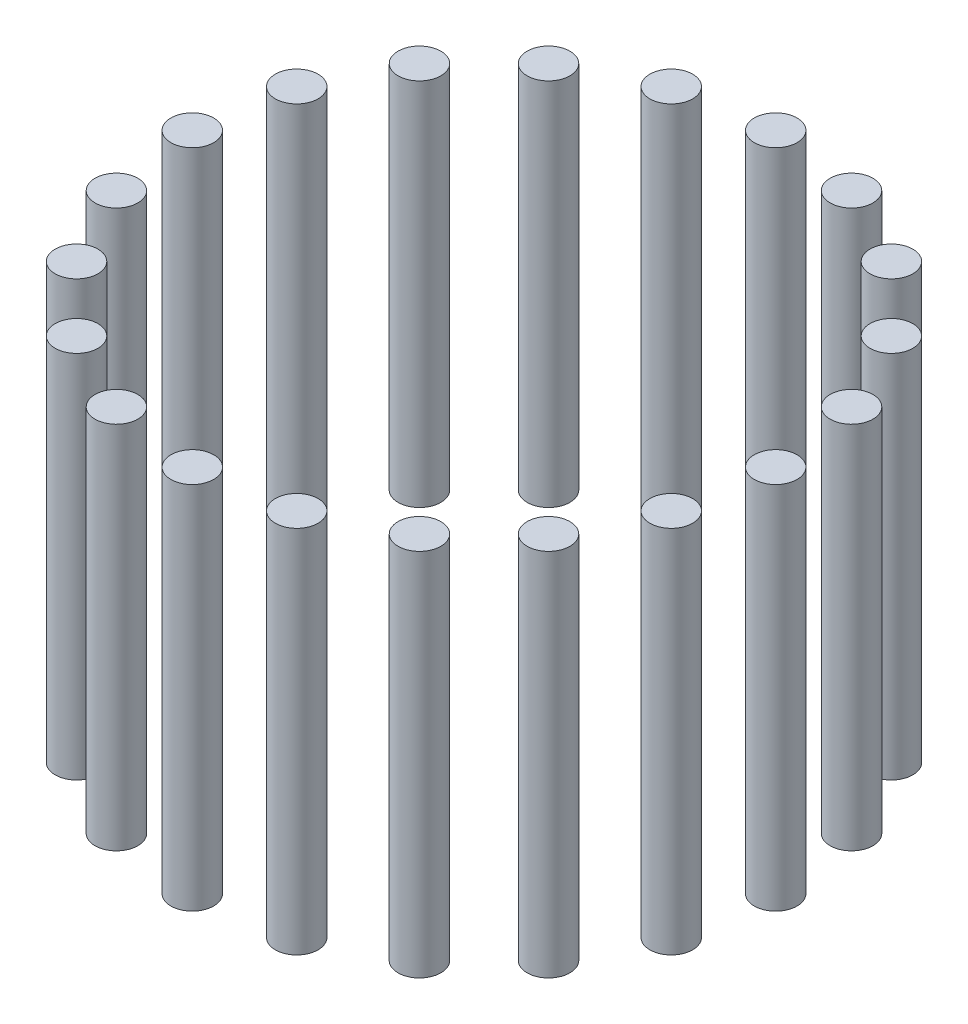
ISO-10303-21;
HEADER;
FILE_DESCRIPTION(('STEP AP214'),'2;1');
FILE_NAME('part.step','',(''),(''),'','','');
FILE_SCHEMA(('AUTOMOTIVE_DESIGN { 1 0 10303 214 1 1 1 1 }'));
ENDSEC;
DATA;
#1=APPLICATION_CONTEXT('core data for automotive mechanical design processes');
#2=APPLICATION_PROTOCOL_DEFINITION('international standard','automotive_design',2000,#1);
#3=PRODUCT_CONTEXT('',#1,'mechanical');
#4=PRODUCT('Part','Part','',(#3));
#5=PRODUCT_RELATED_PRODUCT_CATEGORY('part','',(#4));
#6=PRODUCT_DEFINITION_FORMATION('','',#4);
#7=PRODUCT_DEFINITION_CONTEXT('part definition',#1,'design');
#8=PRODUCT_DEFINITION('design','',#6,#7);
#9=PRODUCT_DEFINITION_SHAPE('','',#8);
#10=(LENGTH_UNIT() NAMED_UNIT(*) SI_UNIT(.MILLI.,.METRE.));
#11=(NAMED_UNIT(*) PLANE_ANGLE_UNIT() SI_UNIT($,.RADIAN.));
#12=(NAMED_UNIT(*) SI_UNIT($,.STERADIAN.) SOLID_ANGLE_UNIT());
#13=UNCERTAINTY_MEASURE_WITH_UNIT(LENGTH_MEASURE(1.E-05),#10,'distance_accuracy_value','');
#14=(GEOMETRIC_REPRESENTATION_CONTEXT(3) GLOBAL_UNCERTAINTY_ASSIGNED_CONTEXT((#13)) GLOBAL_UNIT_ASSIGNED_CONTEXT((#10,
#11,#12)) REPRESENTATION_CONTEXT('',''));
#15=CARTESIAN_POINT('',(0.,0.,0.));
#16=DIRECTION('',(0.,0.,1.));
#17=DIRECTION('',(1.,0.,0.));
#18=AXIS2_PLACEMENT_3D('',#15,#16,#17);
#19=CARTESIAN_POINT('',(-71.3292387221365,95.,-23.1762745781211));
#20=DIRECTION('',(0.,-1.,0.));
#21=DIRECTION('',(0.,0.,-1.));
#22=AXIS2_PLACEMENT_3D('',#19,#20,#21);
#23=CYLINDRICAL_SURFACE('',#22,5.49999999999999);
#24=CARTESIAN_POINT('',(-71.3292387221365,95.,-23.1762745781211));
#25=DIRECTION('',(0.,1.,0.));
#26=DIRECTION('',(0.,0.,1.));
#27=AXIS2_PLACEMENT_3D('',#24,#25,#26);
#28=CIRCLE('',#27,5.49999999999999);
#29=CARTESIAN_POINT('',(-71.3292387221365,95.,-17.6762745781211));
#30=VERTEX_POINT('',#29);
#31=EDGE_CURVE('E50',#30,#30,#28,.T.);
#32=ORIENTED_EDGE('',*,*,#31,.F.);
#33=EDGE_LOOP('',(#32));
#34=FACE_BOUND('',#33,.T.);
#35=CARTESIAN_POINT('',(-71.3292387221365,0.,-23.1762745781211));
#36=DIRECTION('',(0.,1.,0.));
#37=DIRECTION('',(0.,0.,1.));
#38=AXIS2_PLACEMENT_3D('',#35,#36,#37);
#39=CIRCLE('',#38,5.49999999999999);
#40=CARTESIAN_POINT('',(-71.3292387221365,0.,-17.6762745781211));
#41=VERTEX_POINT('',#40);
#42=EDGE_CURVE('E11',#41,#41,#39,.T.);
#43=ORIENTED_EDGE('',*,*,#42,.T.);
#44=EDGE_LOOP('',(#43));
#45=FACE_BOUND('',#44,.T.);
#46=ADVANCED_FACE('F46',(#34,#45),#23,.T.);
#47=CARTESIAN_POINT('',(-71.3292387221365,95.,-23.1762745781211));
#48=DIRECTION('',(0.,1.,0.));
#49=DIRECTION('',(0.,0.,1.));
#50=AXIS2_PLACEMENT_3D('',#47,#48,#49);
#51=PLANE('',#50);
#52=ORIENTED_EDGE('',*,*,#31,.T.);
#53=EDGE_LOOP('',(#52));
#54=FACE_BOUND('',#53,.T.);
#55=ADVANCED_FACE('F48',(#54),#51,.T.);
#56=CARTESIAN_POINT('',(-71.3292387221365,0.,-23.1762745781211));
#57=DIRECTION('',(0.,1.,0.));
#58=DIRECTION('',(0.,0.,1.));
#59=AXIS2_PLACEMENT_3D('',#56,#57,#58);
#60=PLANE('',#59);
#61=ORIENTED_EDGE('',*,*,#42,.F.);
#62=EDGE_LOOP('',(#61));
#63=FACE_BOUND('',#62,.T.);
#64=ADVANCED_FACE('F65',(#63),#60,.F.);
#65=CLOSED_SHELL('',(#46,#55,#64));
#66=MANIFOLD_SOLID_BREP('B2',#65);
#67=CARTESIAN_POINT('',(-60.676274578121,95.,-44.0838939219356));
#68=DIRECTION('',(0.,-1.,0.));
#69=DIRECTION('',(0.,0.,-1.));
#70=AXIS2_PLACEMENT_3D('',#67,#68,#69);
#71=CYLINDRICAL_SURFACE('',#70,5.50000000000001);
#72=CARTESIAN_POINT('',(-60.676274578121,95.,-44.0838939219356));
#73=DIRECTION('',(0.,1.,0.));
#74=DIRECTION('',(0.,0.,1.));
#75=AXIS2_PLACEMENT_3D('',#72,#73,#74);
#76=CIRCLE('',#75,5.50000000000001);
#77=CARTESIAN_POINT('',(-60.676274578121,95.,-38.5838939219356));
#78=VERTEX_POINT('',#77);
#79=EDGE_CURVE('E105',#78,#78,#76,.T.);
#80=ORIENTED_EDGE('',*,*,#79,.F.);
#81=EDGE_LOOP('',(#80));
#82=FACE_BOUND('',#81,.T.);
#83=CARTESIAN_POINT('',(-60.676274578121,0.,-44.0838939219356));
#84=DIRECTION('',(0.,1.,0.));
#85=DIRECTION('',(0.,0.,1.));
#86=AXIS2_PLACEMENT_3D('',#83,#84,#85);
#87=CIRCLE('',#86,5.50000000000001);
#88=CARTESIAN_POINT('',(-60.676274578121,0.,-38.5838939219356));
#89=VERTEX_POINT('',#88);
#90=EDGE_CURVE('E45',#89,#89,#87,.T.);
#91=ORIENTED_EDGE('',*,*,#90,.T.);
#92=EDGE_LOOP('',(#91));
#93=FACE_BOUND('',#92,.T.);
#94=ADVANCED_FACE('F101',(#82,#93),#71,.T.);
#95=CARTESIAN_POINT('',(-60.676274578121,95.,-44.0838939219356));
#96=DIRECTION('',(0.,1.,0.));
#97=DIRECTION('',(0.,0.,1.));
#98=AXIS2_PLACEMENT_3D('',#95,#96,#97);
#99=PLANE('',#98);
#100=ORIENTED_EDGE('',*,*,#79,.T.);
#101=EDGE_LOOP('',(#100));
#102=FACE_BOUND('',#101,.T.);
#103=ADVANCED_FACE('F103',(#102),#99,.T.);
#104=CARTESIAN_POINT('',(-60.676274578121,0.,-44.0838939219356));
#105=DIRECTION('',(0.,1.,0.));
#106=DIRECTION('',(0.,0.,1.));
#107=AXIS2_PLACEMENT_3D('',#104,#105,#106);
#108=PLANE('',#107);
#109=ORIENTED_EDGE('',*,*,#90,.F.);
#110=EDGE_LOOP('',(#109));
#111=FACE_BOUND('',#110,.T.);
#112=ADVANCED_FACE('F120',(#111),#108,.F.);
#113=CLOSED_SHELL('',(#94,#103,#112));
#114=MANIFOLD_SOLID_BREP('B6',#113);
#115=CARTESIAN_POINT('',(-44.0838939219354,95.,-60.6762745781212));
#116=DIRECTION('',(0.,-1.,0.));
#117=DIRECTION('',(0.,0.,-1.));
#118=AXIS2_PLACEMENT_3D('',#115,#116,#117);
#119=CYLINDRICAL_SURFACE('',#118,5.50000000000001);
#120=CARTESIAN_POINT('',(-44.0838939219354,95.,-60.6762745781212));
#121=DIRECTION('',(0.,1.,0.));
#122=DIRECTION('',(0.,0.,1.));
#123=AXIS2_PLACEMENT_3D('',#120,#121,#122);
#124=CIRCLE('',#123,5.50000000000001);
#125=CARTESIAN_POINT('',(-44.0838939219354,95.,-55.1762745781212));
#126=VERTEX_POINT('',#125);
#127=EDGE_CURVE('E160',#126,#126,#124,.T.);
#128=ORIENTED_EDGE('',*,*,#127,.F.);
#129=EDGE_LOOP('',(#128));
#130=FACE_BOUND('',#129,.T.);
#131=CARTESIAN_POINT('',(-44.0838939219354,0.,-60.6762745781212));
#132=DIRECTION('',(0.,1.,0.));
#133=DIRECTION('',(0.,0.,1.));
#134=AXIS2_PLACEMENT_3D('',#131,#132,#133);
#135=CIRCLE('',#134,5.50000000000001);
#136=CARTESIAN_POINT('',(-44.0838939219354,0.,-55.1762745781212));
#137=VERTEX_POINT('',#136);
#138=EDGE_CURVE('E100',#137,#137,#135,.T.);
#139=ORIENTED_EDGE('',*,*,#138,.T.);
#140=EDGE_LOOP('',(#139));
#141=FACE_BOUND('',#140,.T.);
#142=ADVANCED_FACE('F156',(#130,#141),#119,.T.);
#143=CARTESIAN_POINT('',(-44.0838939219354,95.,-60.6762745781212));
#144=DIRECTION('',(0.,1.,0.));
#145=DIRECTION('',(0.,0.,1.));
#146=AXIS2_PLACEMENT_3D('',#143,#144,#145);
#147=PLANE('',#146);
#148=ORIENTED_EDGE('',*,*,#127,.T.);
#149=EDGE_LOOP('',(#148));
#150=FACE_BOUND('',#149,.T.);
#151=ADVANCED_FACE('F158',(#150),#147,.T.);
#152=CARTESIAN_POINT('',(-44.0838939219354,0.,-60.6762745781212));
#153=DIRECTION('',(0.,1.,0.));
#154=DIRECTION('',(0.,0.,1.));
#155=AXIS2_PLACEMENT_3D('',#152,#153,#154);
#156=PLANE('',#155);
#157=ORIENTED_EDGE('',*,*,#138,.F.);
#158=EDGE_LOOP('',(#157));
#159=FACE_BOUND('',#158,.T.);
#160=ADVANCED_FACE('F175',(#159),#156,.F.);
#161=CLOSED_SHELL('',(#142,#151,#160));
#162=MANIFOLD_SOLID_BREP('B40',#161);
#163=CARTESIAN_POINT('',(-23.1762745781209,95.,-71.3292387221366));
#164=DIRECTION('',(0.,-1.,0.));
#165=DIRECTION('',(0.,0.,-1.));
#166=AXIS2_PLACEMENT_3D('',#163,#164,#165);
#167=CYLINDRICAL_SURFACE('',#166,5.49999999999999);
#168=CARTESIAN_POINT('',(-23.1762745781209,95.,-71.3292387221366));
#169=DIRECTION('',(0.,1.,0.));
#170=DIRECTION('',(0.,0.,1.));
#171=AXIS2_PLACEMENT_3D('',#168,#169,#170);
#172=CIRCLE('',#171,5.49999999999999);
#173=CARTESIAN_POINT('',(-23.1762745781209,95.,-65.8292387221366));
#174=VERTEX_POINT('',#173);
#175=EDGE_CURVE('E215',#174,#174,#172,.T.);
#176=ORIENTED_EDGE('',*,*,#175,.F.);
#177=EDGE_LOOP('',(#176));
#178=FACE_BOUND('',#177,.T.);
#179=CARTESIAN_POINT('',(-23.1762745781209,0.,-71.3292387221366));
#180=DIRECTION('',(0.,1.,0.));
#181=DIRECTION('',(0.,0.,1.));
#182=AXIS2_PLACEMENT_3D('',#179,#180,#181);
#183=CIRCLE('',#182,5.49999999999999);
#184=CARTESIAN_POINT('',(-23.1762745781209,0.,-65.8292387221366));
#185=VERTEX_POINT('',#184);
#186=EDGE_CURVE('E155',#185,#185,#183,.T.);
#187=ORIENTED_EDGE('',*,*,#186,.T.);
#188=EDGE_LOOP('',(#187));
#189=FACE_BOUND('',#188,.T.);
#190=ADVANCED_FACE('F211',(#178,#189),#167,.T.);
#191=CARTESIAN_POINT('',(-23.1762745781209,95.,-71.3292387221366));
#192=DIRECTION('',(0.,1.,0.));
#193=DIRECTION('',(0.,0.,1.));
#194=AXIS2_PLACEMENT_3D('',#191,#192,#193);
#195=PLANE('',#194);
#196=ORIENTED_EDGE('',*,*,#175,.T.);
#197=EDGE_LOOP('',(#196));
#198=FACE_BOUND('',#197,.T.);
#199=ADVANCED_FACE('F213',(#198),#195,.T.);
#200=CARTESIAN_POINT('',(-23.1762745781209,0.,-71.3292387221366));
#201=DIRECTION('',(0.,1.,0.));
#202=DIRECTION('',(0.,0.,1.));
#203=AXIS2_PLACEMENT_3D('',#200,#201,#202);
#204=PLANE('',#203);
#205=ORIENTED_EDGE('',*,*,#186,.F.);
#206=EDGE_LOOP('',(#205));
#207=FACE_BOUND('',#206,.T.);
#208=ADVANCED_FACE('F230',(#207),#204,.F.);
#209=CLOSED_SHELL('',(#190,#199,#208));
#210=MANIFOLD_SOLID_BREP('B95',#209);
#211=CARTESIAN_POINT('',(2.61861100413235E-13,95.,-75.));
#212=DIRECTION('',(0.,-1.,0.));
#213=DIRECTION('',(0.,0.,-1.));
#214=AXIS2_PLACEMENT_3D('',#211,#212,#213);
#215=CYLINDRICAL_SURFACE('',#214,5.5);
#216=CARTESIAN_POINT('',(2.61861100413235E-13,95.,-75.));
#217=DIRECTION('',(0.,1.,0.));
#218=DIRECTION('',(0.,0.,1.));
#219=AXIS2_PLACEMENT_3D('',#216,#217,#218);
#220=CIRCLE('',#219,5.5);
#221=CARTESIAN_POINT('',(2.61861100413235E-13,95.,-69.5));
#222=VERTEX_POINT('',#221);
#223=EDGE_CURVE('E270',#222,#222,#220,.T.);
#224=ORIENTED_EDGE('',*,*,#223,.F.);
#225=EDGE_LOOP('',(#224));
#226=FACE_BOUND('',#225,.T.);
#227=CARTESIAN_POINT('',(2.61861100413235E-13,0.,-75.));
#228=DIRECTION('',(0.,1.,0.));
#229=DIRECTION('',(0.,0.,1.));
#230=AXIS2_PLACEMENT_3D('',#227,#228,#229);
#231=CIRCLE('',#230,5.5);
#232=CARTESIAN_POINT('',(2.61861100413235E-13,0.,-69.5));
#233=VERTEX_POINT('',#232);
#234=EDGE_CURVE('E210',#233,#233,#231,.T.);
#235=ORIENTED_EDGE('',*,*,#234,.T.);
#236=EDGE_LOOP('',(#235));
#237=FACE_BOUND('',#236,.T.);
#238=ADVANCED_FACE('F266',(#226,#237),#215,.T.);
#239=CARTESIAN_POINT('',(2.61861100413235E-13,95.,-75.));
#240=DIRECTION('',(0.,1.,0.));
#241=DIRECTION('',(0.,0.,1.));
#242=AXIS2_PLACEMENT_3D('',#239,#240,#241);
#243=PLANE('',#242);
#244=ORIENTED_EDGE('',*,*,#223,.T.);
#245=EDGE_LOOP('',(#244));
#246=FACE_BOUND('',#245,.T.);
#247=ADVANCED_FACE('F268',(#246),#243,.T.);
#248=CARTESIAN_POINT('',(2.61861100413235E-13,0.,-75.));
#249=DIRECTION('',(0.,1.,0.));
#250=DIRECTION('',(0.,0.,1.));
#251=AXIS2_PLACEMENT_3D('',#248,#249,#250);
#252=PLANE('',#251);
#253=ORIENTED_EDGE('',*,*,#234,.F.);
#254=EDGE_LOOP('',(#253));
#255=FACE_BOUND('',#254,.T.);
#256=ADVANCED_FACE('F285',(#255),#252,.F.);
#257=CLOSED_SHELL('',(#238,#247,#256));
#258=MANIFOLD_SOLID_BREP('B150',#257);
#259=CARTESIAN_POINT('',(23.1762745781214,95.,-71.3292387221364));
#260=DIRECTION('',(0.,-1.,0.));
#261=DIRECTION('',(0.,0.,-1.));
#262=AXIS2_PLACEMENT_3D('',#259,#260,#261);
#263=CYLINDRICAL_SURFACE('',#262,5.50000000000001);
#264=CARTESIAN_POINT('',(23.1762745781214,95.,-71.3292387221364));
#265=DIRECTION('',(0.,1.,0.));
#266=DIRECTION('',(0.,0.,1.));
#267=AXIS2_PLACEMENT_3D('',#264,#265,#266);
#268=CIRCLE('',#267,5.50000000000001);
#269=CARTESIAN_POINT('',(23.1762745781214,95.,-65.8292387221364));
#270=VERTEX_POINT('',#269);
#271=EDGE_CURVE('E325',#270,#270,#268,.T.);
#272=ORIENTED_EDGE('',*,*,#271,.F.);
#273=EDGE_LOOP('',(#272));
#274=FACE_BOUND('',#273,.T.);
#275=CARTESIAN_POINT('',(23.1762745781214,0.,-71.3292387221364));
#276=DIRECTION('',(0.,1.,0.));
#277=DIRECTION('',(0.,0.,1.));
#278=AXIS2_PLACEMENT_3D('',#275,#276,#277);
#279=CIRCLE('',#278,5.50000000000001);
#280=CARTESIAN_POINT('',(23.1762745781214,0.,-65.8292387221364));
#281=VERTEX_POINT('',#280);
#282=EDGE_CURVE('E265',#281,#281,#279,.T.);
#283=ORIENTED_EDGE('',*,*,#282,.T.);
#284=EDGE_LOOP('',(#283));
#285=FACE_BOUND('',#284,.T.);
#286=ADVANCED_FACE('F321',(#274,#285),#263,.T.);
#287=CARTESIAN_POINT('',(23.1762745781214,95.,-71.3292387221364));
#288=DIRECTION('',(0.,1.,0.));
#289=DIRECTION('',(0.,0.,1.));
#290=AXIS2_PLACEMENT_3D('',#287,#288,#289);
#291=PLANE('',#290);
#292=ORIENTED_EDGE('',*,*,#271,.T.);
#293=EDGE_LOOP('',(#292));
#294=FACE_BOUND('',#293,.T.);
#295=ADVANCED_FACE('F323',(#294),#291,.T.);
#296=CARTESIAN_POINT('',(23.1762745781214,0.,-71.3292387221364));
#297=DIRECTION('',(0.,1.,0.));
#298=DIRECTION('',(0.,0.,1.));
#299=AXIS2_PLACEMENT_3D('',#296,#297,#298);
#300=PLANE('',#299);
#301=ORIENTED_EDGE('',*,*,#282,.F.);
#302=EDGE_LOOP('',(#301));
#303=FACE_BOUND('',#302,.T.);
#304=ADVANCED_FACE('F340',(#303),#300,.F.);
#305=CLOSED_SHELL('',(#286,#295,#304));
#306=MANIFOLD_SOLID_BREP('B205',#305);
#307=CARTESIAN_POINT('',(44.0838939219358,95.,-60.6762745781209));
#308=DIRECTION('',(0.,-1.,0.));
#309=DIRECTION('',(0.,0.,-1.));
#310=AXIS2_PLACEMENT_3D('',#307,#308,#309);
#311=CYLINDRICAL_SURFACE('',#310,5.50000000000001);
#312=CARTESIAN_POINT('',(44.0838939219358,95.,-60.6762745781209));
#313=DIRECTION('',(0.,1.,0.));
#314=DIRECTION('',(0.,0.,1.));
#315=AXIS2_PLACEMENT_3D('',#312,#313,#314);
#316=CIRCLE('',#315,5.50000000000001);
#317=CARTESIAN_POINT('',(44.0838939219358,95.,-55.1762745781208));
#318=VERTEX_POINT('',#317);
#319=EDGE_CURVE('E380',#318,#318,#316,.T.);
#320=ORIENTED_EDGE('',*,*,#319,.F.);
#321=EDGE_LOOP('',(#320));
#322=FACE_BOUND('',#321,.T.);
#323=CARTESIAN_POINT('',(44.0838939219358,0.,-60.6762745781209));
#324=DIRECTION('',(0.,1.,0.));
#325=DIRECTION('',(0.,0.,1.));
#326=AXIS2_PLACEMENT_3D('',#323,#324,#325);
#327=CIRCLE('',#326,5.50000000000001);
#328=CARTESIAN_POINT('',(44.0838939219358,0.,-55.1762745781208));
#329=VERTEX_POINT('',#328);
#330=EDGE_CURVE('E320',#329,#329,#327,.T.);
#331=ORIENTED_EDGE('',*,*,#330,.T.);
#332=EDGE_LOOP('',(#331));
#333=FACE_BOUND('',#332,.T.);
#334=ADVANCED_FACE('F376',(#322,#333),#311,.T.);
#335=CARTESIAN_POINT('',(44.0838939219358,95.,-60.6762745781209));
#336=DIRECTION('',(0.,1.,0.));
#337=DIRECTION('',(0.,0.,1.));
#338=AXIS2_PLACEMENT_3D('',#335,#336,#337);
#339=PLANE('',#338);
#340=ORIENTED_EDGE('',*,*,#319,.T.);
#341=EDGE_LOOP('',(#340));
#342=FACE_BOUND('',#341,.T.);
#343=ADVANCED_FACE('F378',(#342),#339,.T.);
#344=CARTESIAN_POINT('',(44.0838939219358,0.,-60.6762745781209));
#345=DIRECTION('',(0.,1.,0.));
#346=DIRECTION('',(0.,0.,1.));
#347=AXIS2_PLACEMENT_3D('',#344,#345,#346);
#348=PLANE('',#347);
#349=ORIENTED_EDGE('',*,*,#330,.F.);
#350=EDGE_LOOP('',(#349));
#351=FACE_BOUND('',#350,.T.);
#352=ADVANCED_FACE('F395',(#351),#348,.F.);
#353=CLOSED_SHELL('',(#334,#343,#352));
#354=MANIFOLD_SOLID_BREP('B260',#353);
#355=CARTESIAN_POINT('',(60.6762745781213,95.,-44.0838939219352));
#356=DIRECTION('',(0.,-1.,0.));
#357=DIRECTION('',(0.,0.,-1.));
#358=AXIS2_PLACEMENT_3D('',#355,#356,#357);
#359=CYLINDRICAL_SURFACE('',#358,5.5);
#360=CARTESIAN_POINT('',(60.6762745781213,95.,-44.0838939219352));
#361=DIRECTION('',(0.,1.,0.));
#362=DIRECTION('',(0.,0.,1.));
#363=AXIS2_PLACEMENT_3D('',#360,#361,#362);
#364=CIRCLE('',#363,5.5);
#365=CARTESIAN_POINT('',(60.6762745781213,95.,-38.5838939219352));
#366=VERTEX_POINT('',#365);
#367=EDGE_CURVE('E435',#366,#366,#364,.T.);
#368=ORIENTED_EDGE('',*,*,#367,.F.);
#369=EDGE_LOOP('',(#368));
#370=FACE_BOUND('',#369,.T.);
#371=CARTESIAN_POINT('',(60.6762745781213,0.,-44.0838939219352));
#372=DIRECTION('',(0.,1.,0.));
#373=DIRECTION('',(0.,0.,1.));
#374=AXIS2_PLACEMENT_3D('',#371,#372,#373);
#375=CIRCLE('',#374,5.5);
#376=CARTESIAN_POINT('',(60.6762745781213,0.,-38.5838939219352));
#377=VERTEX_POINT('',#376);
#378=EDGE_CURVE('E375',#377,#377,#375,.T.);
#379=ORIENTED_EDGE('',*,*,#378,.T.);
#380=EDGE_LOOP('',(#379));
#381=FACE_BOUND('',#380,.T.);
#382=ADVANCED_FACE('F431',(#370,#381),#359,.T.);
#383=CARTESIAN_POINT('',(60.6762745781213,95.,-44.0838939219352));
#384=DIRECTION('',(0.,1.,0.));
#385=DIRECTION('',(0.,0.,1.));
#386=AXIS2_PLACEMENT_3D('',#383,#384,#385);
#387=PLANE('',#386);
#388=ORIENTED_EDGE('',*,*,#367,.T.);
#389=EDGE_LOOP('',(#388));
#390=FACE_BOUND('',#389,.T.);
#391=ADVANCED_FACE('F433',(#390),#387,.T.);
#392=CARTESIAN_POINT('',(60.6762745781213,0.,-44.0838939219352));
#393=DIRECTION('',(0.,1.,0.));
#394=DIRECTION('',(0.,0.,1.));
#395=AXIS2_PLACEMENT_3D('',#392,#393,#394);
#396=PLANE('',#395);
#397=ORIENTED_EDGE('',*,*,#378,.F.);
#398=EDGE_LOOP('',(#397));
#399=FACE_BOUND('',#398,.T.);
#400=ADVANCED_FACE('F450',(#399),#396,.F.);
#401=CLOSED_SHELL('',(#382,#391,#400));
#402=MANIFOLD_SOLID_BREP('B315',#401);
#403=CARTESIAN_POINT('',(71.3292387221367,95.,-23.1762745781206));
#404=DIRECTION('',(0.,-1.,0.));
#405=DIRECTION('',(0.,0.,-1.));
#406=AXIS2_PLACEMENT_3D('',#403,#404,#405);
#407=CYLINDRICAL_SURFACE('',#406,5.5);
#408=CARTESIAN_POINT('',(71.3292387221367,95.,-23.1762745781206));
#409=DIRECTION('',(0.,1.,0.));
#410=DIRECTION('',(0.,0.,1.));
#411=AXIS2_PLACEMENT_3D('',#408,#409,#410);
#412=CIRCLE('',#411,5.5);
#413=CARTESIAN_POINT('',(71.3292387221367,95.,-17.6762745781206));
#414=VERTEX_POINT('',#413);
#415=EDGE_CURVE('E490',#414,#414,#412,.T.);
#416=ORIENTED_EDGE('',*,*,#415,.F.);
#417=EDGE_LOOP('',(#416));
#418=FACE_BOUND('',#417,.T.);
#419=CARTESIAN_POINT('',(71.3292387221367,0.,-23.1762745781206));
#420=DIRECTION('',(0.,1.,0.));
#421=DIRECTION('',(0.,0.,1.));
#422=AXIS2_PLACEMENT_3D('',#419,#420,#421);
#423=CIRCLE('',#422,5.5);
#424=CARTESIAN_POINT('',(71.3292387221367,0.,-17.6762745781206));
#425=VERTEX_POINT('',#424);
#426=EDGE_CURVE('E430',#425,#425,#423,.T.);
#427=ORIENTED_EDGE('',*,*,#426,.T.);
#428=EDGE_LOOP('',(#427));
#429=FACE_BOUND('',#428,.T.);
#430=ADVANCED_FACE('F486',(#418,#429),#407,.T.);
#431=CARTESIAN_POINT('',(71.3292387221367,95.,-23.1762745781206));
#432=DIRECTION('',(0.,1.,0.));
#433=DIRECTION('',(0.,0.,1.));
#434=AXIS2_PLACEMENT_3D('',#431,#432,#433);
#435=PLANE('',#434);
#436=ORIENTED_EDGE('',*,*,#415,.T.);
#437=EDGE_LOOP('',(#436));
#438=FACE_BOUND('',#437,.T.);
#439=ADVANCED_FACE('F488',(#438),#435,.T.);
#440=CARTESIAN_POINT('',(71.3292387221367,0.,-23.1762745781206));
#441=DIRECTION('',(0.,1.,0.));
#442=DIRECTION('',(0.,0.,1.));
#443=AXIS2_PLACEMENT_3D('',#440,#441,#442);
#444=PLANE('',#443);
#445=ORIENTED_EDGE('',*,*,#426,.F.);
#446=EDGE_LOOP('',(#445));
#447=FACE_BOUND('',#446,.T.);
#448=ADVANCED_FACE('F505',(#447),#444,.F.);
#449=CLOSED_SHELL('',(#430,#439,#448));
#450=MANIFOLD_SOLID_BREP('B370',#449);
#451=CARTESIAN_POINT('',(75.,95.,5.2372220082647E-13));
#452=DIRECTION('',(0.,-1.,0.));
#453=DIRECTION('',(0.,0.,-1.));
#454=AXIS2_PLACEMENT_3D('',#451,#452,#453);
#455=CYLINDRICAL_SURFACE('',#454,5.50000000000001);
#456=CARTESIAN_POINT('',(75.,95.,5.2372220082647E-13));
#457=DIRECTION('',(0.,1.,0.));
#458=DIRECTION('',(0.,0.,1.));
#459=AXIS2_PLACEMENT_3D('',#456,#457,#458);
#460=CIRCLE('',#459,5.50000000000001);
#461=CARTESIAN_POINT('',(75.,95.,5.50000000000053));
#462=VERTEX_POINT('',#461);
#463=EDGE_CURVE('E545',#462,#462,#460,.T.);
#464=ORIENTED_EDGE('',*,*,#463,.F.);
#465=EDGE_LOOP('',(#464));
#466=FACE_BOUND('',#465,.T.);
#467=CARTESIAN_POINT('',(75.,0.,5.2372220082647E-13));
#468=DIRECTION('',(0.,1.,0.));
#469=DIRECTION('',(0.,0.,1.));
#470=AXIS2_PLACEMENT_3D('',#467,#468,#469);
#471=CIRCLE('',#470,5.50000000000001);
#472=CARTESIAN_POINT('',(75.,0.,5.50000000000053));
#473=VERTEX_POINT('',#472);
#474=EDGE_CURVE('E485',#473,#473,#471,.T.);
#475=ORIENTED_EDGE('',*,*,#474,.T.);
#476=EDGE_LOOP('',(#475));
#477=FACE_BOUND('',#476,.T.);
#478=ADVANCED_FACE('F541',(#466,#477),#455,.T.);
#479=CARTESIAN_POINT('',(75.,95.,5.2372220082647E-13));
#480=DIRECTION('',(0.,1.,0.));
#481=DIRECTION('',(0.,0.,1.));
#482=AXIS2_PLACEMENT_3D('',#479,#480,#481);
#483=PLANE('',#482);
#484=ORIENTED_EDGE('',*,*,#463,.T.);
#485=EDGE_LOOP('',(#484));
#486=FACE_BOUND('',#485,.T.);
#487=ADVANCED_FACE('F543',(#486),#483,.T.);
#488=CARTESIAN_POINT('',(75.,0.,5.2372220082647E-13));
#489=DIRECTION('',(0.,1.,0.));
#490=DIRECTION('',(0.,0.,1.));
#491=AXIS2_PLACEMENT_3D('',#488,#489,#490);
#492=PLANE('',#491);
#493=ORIENTED_EDGE('',*,*,#474,.F.);
#494=EDGE_LOOP('',(#493));
#495=FACE_BOUND('',#494,.T.);
#496=ADVANCED_FACE('F560',(#495),#492,.F.);
#497=CLOSED_SHELL('',(#478,#487,#496));
#498=MANIFOLD_SOLID_BREP('B425',#497);
#499=CARTESIAN_POINT('',(71.3292387221363,95.,23.1762745781216));
#500=DIRECTION('',(0.,-1.,0.));
#501=DIRECTION('',(0.,0.,-1.));
#502=AXIS2_PLACEMENT_3D('',#499,#500,#501);
#503=CYLINDRICAL_SURFACE('',#502,5.50000000000001);
#504=CARTESIAN_POINT('',(71.3292387221363,95.,23.1762745781216));
#505=DIRECTION('',(0.,1.,0.));
#506=DIRECTION('',(0.,0.,1.));
#507=AXIS2_PLACEMENT_3D('',#504,#505,#506);
#508=CIRCLE('',#507,5.50000000000001);
#509=CARTESIAN_POINT('',(71.3292387221363,95.,28.6762745781216));
#510=VERTEX_POINT('',#509);
#511=EDGE_CURVE('E600',#510,#510,#508,.T.);
#512=ORIENTED_EDGE('',*,*,#511,.F.);
#513=EDGE_LOOP('',(#512));
#514=FACE_BOUND('',#513,.T.);
#515=CARTESIAN_POINT('',(71.3292387221363,0.,23.1762745781216));
#516=DIRECTION('',(0.,1.,0.));
#517=DIRECTION('',(0.,0.,1.));
#518=AXIS2_PLACEMENT_3D('',#515,#516,#517);
#519=CIRCLE('',#518,5.50000000000001);
#520=CARTESIAN_POINT('',(71.3292387221363,0.,28.6762745781216));
#521=VERTEX_POINT('',#520);
#522=EDGE_CURVE('E540',#521,#521,#519,.T.);
#523=ORIENTED_EDGE('',*,*,#522,.T.);
#524=EDGE_LOOP('',(#523));
#525=FACE_BOUND('',#524,.T.);
#526=ADVANCED_FACE('F596',(#514,#525),#503,.T.);
#527=CARTESIAN_POINT('',(71.3292387221363,95.,23.1762745781216));
#528=DIRECTION('',(0.,1.,0.));
#529=DIRECTION('',(0.,0.,1.));
#530=AXIS2_PLACEMENT_3D('',#527,#528,#529);
#531=PLANE('',#530);
#532=ORIENTED_EDGE('',*,*,#511,.T.);
#533=EDGE_LOOP('',(#532));
#534=FACE_BOUND('',#533,.T.);
#535=ADVANCED_FACE('F598',(#534),#531,.T.);
#536=CARTESIAN_POINT('',(71.3292387221363,0.,23.1762745781216));
#537=DIRECTION('',(0.,1.,0.));
#538=DIRECTION('',(0.,0.,1.));
#539=AXIS2_PLACEMENT_3D('',#536,#537,#538);
#540=PLANE('',#539);
#541=ORIENTED_EDGE('',*,*,#522,.F.);
#542=EDGE_LOOP('',(#541));
#543=FACE_BOUND('',#542,.T.);
#544=ADVANCED_FACE('F615',(#543),#540,.F.);
#545=CLOSED_SHELL('',(#526,#535,#544));
#546=MANIFOLD_SOLID_BREP('B480',#545);
#547=CARTESIAN_POINT('',(60.6762745781207,95.,44.083893921936));
#548=DIRECTION('',(0.,-1.,0.));
#549=DIRECTION('',(0.,0.,-1.));
#550=AXIS2_PLACEMENT_3D('',#547,#548,#549);
#551=CYLINDRICAL_SURFACE('',#550,5.5);
#552=CARTESIAN_POINT('',(60.6762745781207,95.,44.083893921936));
#553=DIRECTION('',(0.,1.,0.));
#554=DIRECTION('',(0.,0.,1.));
#555=AXIS2_PLACEMENT_3D('',#552,#553,#554);
#556=CIRCLE('',#555,5.5);
#557=CARTESIAN_POINT('',(60.6762745781207,95.,49.583893921936));
#558=VERTEX_POINT('',#557);
#559=EDGE_CURVE('E655',#558,#558,#556,.T.);
#560=ORIENTED_EDGE('',*,*,#559,.F.);
#561=EDGE_LOOP('',(#560));
#562=FACE_BOUND('',#561,.T.);
#563=CARTESIAN_POINT('',(60.6762745781207,0.,44.083893921936));
#564=DIRECTION('',(0.,1.,0.));
#565=DIRECTION('',(0.,0.,1.));
#566=AXIS2_PLACEMENT_3D('',#563,#564,#565);
#567=CIRCLE('',#566,5.5);
#568=CARTESIAN_POINT('',(60.6762745781207,0.,49.583893921936));
#569=VERTEX_POINT('',#568);
#570=EDGE_CURVE('E595',#569,#569,#567,.T.);
#571=ORIENTED_EDGE('',*,*,#570,.T.);
#572=EDGE_LOOP('',(#571));
#573=FACE_BOUND('',#572,.T.);
#574=ADVANCED_FACE('F651',(#562,#573),#551,.T.);
#575=CARTESIAN_POINT('',(60.6762745781207,95.,44.083893921936));
#576=DIRECTION('',(0.,1.,0.));
#577=DIRECTION('',(0.,0.,1.));
#578=AXIS2_PLACEMENT_3D('',#575,#576,#577);
#579=PLANE('',#578);
#580=ORIENTED_EDGE('',*,*,#559,.T.);
#581=EDGE_LOOP('',(#580));
#582=FACE_BOUND('',#581,.T.);
#583=ADVANCED_FACE('F653',(#582),#579,.T.);
#584=CARTESIAN_POINT('',(60.6762745781207,0.,44.083893921936));
#585=DIRECTION('',(0.,1.,0.));
#586=DIRECTION('',(0.,0.,1.));
#587=AXIS2_PLACEMENT_3D('',#584,#585,#586);
#588=PLANE('',#587);
#589=ORIENTED_EDGE('',*,*,#570,.F.);
#590=EDGE_LOOP('',(#589));
#591=FACE_BOUND('',#590,.T.);
#592=ADVANCED_FACE('F670',(#591),#588,.F.);
#593=CLOSED_SHELL('',(#574,#583,#592));
#594=MANIFOLD_SOLID_BREP('B535',#593);
#595=CARTESIAN_POINT('',(44.0838939219349,95.,60.6762745781215));
#596=DIRECTION('',(0.,-1.,0.));
#597=DIRECTION('',(0.,0.,-1.));
#598=AXIS2_PLACEMENT_3D('',#595,#596,#597);
#599=CYLINDRICAL_SURFACE('',#598,5.5);
#600=CARTESIAN_POINT('',(44.0838939219349,95.,60.6762745781215));
#601=DIRECTION('',(0.,1.,0.));
#602=DIRECTION('',(0.,0.,1.));
#603=AXIS2_PLACEMENT_3D('',#600,#601,#602);
#604=CIRCLE('',#603,5.5);
#605=CARTESIAN_POINT('',(44.0838939219349,95.,66.1762745781215));
#606=VERTEX_POINT('',#605);
#607=EDGE_CURVE('E710',#606,#606,#604,.T.);
#608=ORIENTED_EDGE('',*,*,#607,.F.);
#609=EDGE_LOOP('',(#608));
#610=FACE_BOUND('',#609,.T.);
#611=CARTESIAN_POINT('',(44.0838939219349,0.,60.6762745781215));
#612=DIRECTION('',(0.,1.,0.));
#613=DIRECTION('',(0.,0.,1.));
#614=AXIS2_PLACEMENT_3D('',#611,#612,#613);
#615=CIRCLE('',#614,5.5);
#616=CARTESIAN_POINT('',(44.0838939219349,0.,66.1762745781215));
#617=VERTEX_POINT('',#616);
#618=EDGE_CURVE('E650',#617,#617,#615,.T.);
#619=ORIENTED_EDGE('',*,*,#618,.T.);
#620=EDGE_LOOP('',(#619));
#621=FACE_BOUND('',#620,.T.);
#622=ADVANCED_FACE('F706',(#610,#621),#599,.T.);
#623=CARTESIAN_POINT('',(44.0838939219349,95.,60.6762745781215));
#624=DIRECTION('',(0.,1.,0.));
#625=DIRECTION('',(0.,0.,1.));
#626=AXIS2_PLACEMENT_3D('',#623,#624,#625);
#627=PLANE('',#626);
#628=ORIENTED_EDGE('',*,*,#607,.T.);
#629=EDGE_LOOP('',(#628));
#630=FACE_BOUND('',#629,.T.);
#631=ADVANCED_FACE('F708',(#630),#627,.T.);
#632=CARTESIAN_POINT('',(44.0838939219349,0.,60.6762745781215));
#633=DIRECTION('',(0.,1.,0.));
#634=DIRECTION('',(0.,0.,1.));
#635=AXIS2_PLACEMENT_3D('',#632,#633,#634);
#636=PLANE('',#635);
#637=ORIENTED_EDGE('',*,*,#618,.F.);
#638=EDGE_LOOP('',(#637));
#639=FACE_BOUND('',#638,.T.);
#640=ADVANCED_FACE('F725',(#639),#636,.F.);
#641=CLOSED_SHELL('',(#622,#631,#640));
#642=MANIFOLD_SOLID_BREP('B590',#641);
#643=CARTESIAN_POINT('',(23.1762745781204,95.,71.3292387221368));
#644=DIRECTION('',(0.,-1.,0.));
#645=DIRECTION('',(0.,0.,-1.));
#646=AXIS2_PLACEMENT_3D('',#643,#644,#645);
#647=CYLINDRICAL_SURFACE('',#646,5.50000000000001);
#648=CARTESIAN_POINT('',(23.1762745781204,95.,71.3292387221368));
#649=DIRECTION('',(0.,1.,0.));
#650=DIRECTION('',(0.,0.,1.));
#651=AXIS2_PLACEMENT_3D('',#648,#649,#650);
#652=CIRCLE('',#651,5.50000000000001);
#653=CARTESIAN_POINT('',(23.1762745781204,95.,76.8292387221368));
#654=VERTEX_POINT('',#653);
#655=EDGE_CURVE('E765',#654,#654,#652,.T.);
#656=ORIENTED_EDGE('',*,*,#655,.F.);
#657=EDGE_LOOP('',(#656));
#658=FACE_BOUND('',#657,.T.);
#659=CARTESIAN_POINT('',(23.1762745781204,0.,71.3292387221368));
#660=DIRECTION('',(0.,1.,0.));
#661=DIRECTION('',(0.,0.,1.));
#662=AXIS2_PLACEMENT_3D('',#659,#660,#661);
#663=CIRCLE('',#662,5.50000000000001);
#664=CARTESIAN_POINT('',(23.1762745781204,0.,76.8292387221368));
#665=VERTEX_POINT('',#664);
#666=EDGE_CURVE('E705',#665,#665,#663,.T.);
#667=ORIENTED_EDGE('',*,*,#666,.T.);
#668=EDGE_LOOP('',(#667));
#669=FACE_BOUND('',#668,.T.);
#670=ADVANCED_FACE('F761',(#658,#669),#647,.T.);
#671=CARTESIAN_POINT('',(23.1762745781204,95.,71.3292387221368));
#672=DIRECTION('',(0.,1.,0.));
#673=DIRECTION('',(0.,0.,1.));
#674=AXIS2_PLACEMENT_3D('',#671,#672,#673);
#675=PLANE('',#674);
#676=ORIENTED_EDGE('',*,*,#655,.T.);
#677=EDGE_LOOP('',(#676));
#678=FACE_BOUND('',#677,.T.);
#679=ADVANCED_FACE('F763',(#678),#675,.T.);
#680=CARTESIAN_POINT('',(23.1762745781204,0.,71.3292387221368));
#681=DIRECTION('',(0.,1.,0.));
#682=DIRECTION('',(0.,0.,1.));
#683=AXIS2_PLACEMENT_3D('',#680,#681,#682);
#684=PLANE('',#683);
#685=ORIENTED_EDGE('',*,*,#666,.F.);
#686=EDGE_LOOP('',(#685));
#687=FACE_BOUND('',#686,.T.);
#688=ADVANCED_FACE('F780',(#687),#684,.F.);
#689=CLOSED_SHELL('',(#670,#679,#688));
#690=MANIFOLD_SOLID_BREP('B645',#689);
#691=CARTESIAN_POINT('',(-7.85583301239705E-13,95.,75.));
#692=DIRECTION('',(0.,-1.,0.));
#693=DIRECTION('',(0.,0.,-1.));
#694=AXIS2_PLACEMENT_3D('',#691,#692,#693);
#695=CYLINDRICAL_SURFACE('',#694,5.5);
#696=CARTESIAN_POINT('',(-7.85583301239705E-13,95.,75.));
#697=DIRECTION('',(0.,1.,0.));
#698=DIRECTION('',(0.,0.,1.));
#699=AXIS2_PLACEMENT_3D('',#696,#697,#698);
#700=CIRCLE('',#699,5.5);
#701=CARTESIAN_POINT('',(-7.85583301239705E-13,95.,80.5));
#702=VERTEX_POINT('',#701);
#703=EDGE_CURVE('E820',#702,#702,#700,.T.);
#704=ORIENTED_EDGE('',*,*,#703,.F.);
#705=EDGE_LOOP('',(#704));
#706=FACE_BOUND('',#705,.T.);
#707=CARTESIAN_POINT('',(-7.85583301239705E-13,0.,75.));
#708=DIRECTION('',(0.,1.,0.));
#709=DIRECTION('',(0.,0.,1.));
#710=AXIS2_PLACEMENT_3D('',#707,#708,#709);
#711=CIRCLE('',#710,5.5);
#712=CARTESIAN_POINT('',(-7.85583301239705E-13,0.,80.5));
#713=VERTEX_POINT('',#712);
#714=EDGE_CURVE('E760',#713,#713,#711,.T.);
#715=ORIENTED_EDGE('',*,*,#714,.T.);
#716=EDGE_LOOP('',(#715));
#717=FACE_BOUND('',#716,.T.);
#718=ADVANCED_FACE('F816',(#706,#717),#695,.T.);
#719=CARTESIAN_POINT('',(-7.85583301239705E-13,95.,75.));
#720=DIRECTION('',(0.,1.,0.));
#721=DIRECTION('',(0.,0.,1.));
#722=AXIS2_PLACEMENT_3D('',#719,#720,#721);
#723=PLANE('',#722);
#724=ORIENTED_EDGE('',*,*,#703,.T.);
#725=EDGE_LOOP('',(#724));
#726=FACE_BOUND('',#725,.T.);
#727=ADVANCED_FACE('F818',(#726),#723,.T.);
#728=CARTESIAN_POINT('',(-7.85583301239705E-13,0.,75.));
#729=DIRECTION('',(0.,1.,0.));
#730=DIRECTION('',(0.,0.,1.));
#731=AXIS2_PLACEMENT_3D('',#728,#729,#730);
#732=PLANE('',#731);
#733=ORIENTED_EDGE('',*,*,#714,.F.);
#734=EDGE_LOOP('',(#733));
#735=FACE_BOUND('',#734,.T.);
#736=ADVANCED_FACE('F835',(#735),#732,.F.);
#737=CLOSED_SHELL('',(#718,#727,#736));
#738=MANIFOLD_SOLID_BREP('B700',#737);
#739=CARTESIAN_POINT('',(-44.0838939219362,95.,60.6762745781205));
#740=DIRECTION('',(0.,-1.,0.));
#741=DIRECTION('',(0.,0.,-1.));
#742=AXIS2_PLACEMENT_3D('',#739,#740,#741);
#743=CYLINDRICAL_SURFACE('',#742,5.49999999999999);
#744=CARTESIAN_POINT('',(-44.0838939219362,95.,60.6762745781205));
#745=DIRECTION('',(0.,1.,0.));
#746=DIRECTION('',(0.,0.,1.));
#747=AXIS2_PLACEMENT_3D('',#744,#745,#746);
#748=CIRCLE('',#747,5.49999999999999);
#749=CARTESIAN_POINT('',(-44.0838939219362,95.,66.1762745781205));
#750=VERTEX_POINT('',#749);
#751=EDGE_CURVE('E875',#750,#750,#748,.T.);
#752=ORIENTED_EDGE('',*,*,#751,.F.);
#753=EDGE_LOOP('',(#752));
#754=FACE_BOUND('',#753,.T.);
#755=CARTESIAN_POINT('',(-44.0838939219362,0.,60.6762745781205));
#756=DIRECTION('',(0.,1.,0.));
#757=DIRECTION('',(0.,0.,1.));
#758=AXIS2_PLACEMENT_3D('',#755,#756,#757);
#759=CIRCLE('',#758,5.49999999999999);
#760=CARTESIAN_POINT('',(-44.0838939219362,0.,66.1762745781205));
#761=VERTEX_POINT('',#760);
#762=EDGE_CURVE('E815',#761,#761,#759,.T.);
#763=ORIENTED_EDGE('',*,*,#762,.T.);
#764=EDGE_LOOP('',(#763));
#765=FACE_BOUND('',#764,.T.);
#766=ADVANCED_FACE('F871',(#754,#765),#743,.T.);
#767=CARTESIAN_POINT('',(-44.0838939219362,95.,60.6762745781205));
#768=DIRECTION('',(0.,1.,0.));
#769=DIRECTION('',(0.,0.,1.));
#770=AXIS2_PLACEMENT_3D('',#767,#768,#769);
#771=PLANE('',#770);
#772=ORIENTED_EDGE('',*,*,#751,.T.);
#773=EDGE_LOOP('',(#772));
#774=FACE_BOUND('',#773,.T.);
#775=ADVANCED_FACE('F873',(#774),#771,.T.);
#776=CARTESIAN_POINT('',(-44.0838939219362,0.,60.6762745781205));
#777=DIRECTION('',(0.,1.,0.));
#778=DIRECTION('',(0.,0.,1.));
#779=AXIS2_PLACEMENT_3D('',#776,#777,#778);
#780=PLANE('',#779);
#781=ORIENTED_EDGE('',*,*,#762,.F.);
#782=EDGE_LOOP('',(#781));
#783=FACE_BOUND('',#782,.T.);
#784=ADVANCED_FACE('F890',(#783),#780,.F.);
#785=CLOSED_SHELL('',(#766,#775,#784));
#786=MANIFOLD_SOLID_BREP('B755',#785);
#787=CARTESIAN_POINT('',(-60.6762745781216,95.,44.0838939219347));
#788=DIRECTION('',(0.,-1.,0.));
#789=DIRECTION('',(0.,0.,-1.));
#790=AXIS2_PLACEMENT_3D('',#787,#788,#789);
#791=CYLINDRICAL_SURFACE('',#790,5.50000000000001);
#792=CARTESIAN_POINT('',(-60.6762745781216,95.,44.0838939219347));
#793=DIRECTION('',(0.,1.,0.));
#794=DIRECTION('',(0.,0.,1.));
#795=AXIS2_PLACEMENT_3D('',#792,#793,#794);
#796=CIRCLE('',#795,5.50000000000001);
#797=CARTESIAN_POINT('',(-60.6762745781216,95.,49.5838939219347));
#798=VERTEX_POINT('',#797);
#799=EDGE_CURVE('E930',#798,#798,#796,.T.);
#800=ORIENTED_EDGE('',*,*,#799,.F.);
#801=EDGE_LOOP('',(#800));
#802=FACE_BOUND('',#801,.T.);
#803=CARTESIAN_POINT('',(-60.6762745781216,0.,44.0838939219347));
#804=DIRECTION('',(0.,1.,0.));
#805=DIRECTION('',(0.,0.,1.));
#806=AXIS2_PLACEMENT_3D('',#803,#804,#805);
#807=CIRCLE('',#806,5.50000000000001);
#808=CARTESIAN_POINT('',(-60.6762745781216,0.,49.5838939219347));
#809=VERTEX_POINT('',#808);
#810=EDGE_CURVE('E870',#809,#809,#807,.T.);
#811=ORIENTED_EDGE('',*,*,#810,.T.);
#812=EDGE_LOOP('',(#811));
#813=FACE_BOUND('',#812,.T.);
#814=ADVANCED_FACE('F926',(#802,#813),#791,.T.);
#815=CARTESIAN_POINT('',(-60.6762745781216,95.,44.0838939219347));
#816=DIRECTION('',(0.,1.,0.));
#817=DIRECTION('',(0.,0.,1.));
#818=AXIS2_PLACEMENT_3D('',#815,#816,#817);
#819=PLANE('',#818);
#820=ORIENTED_EDGE('',*,*,#799,.T.);
#821=EDGE_LOOP('',(#820));
#822=FACE_BOUND('',#821,.T.);
#823=ADVANCED_FACE('F928',(#822),#819,.T.);
#824=CARTESIAN_POINT('',(-60.6762745781216,0.,44.0838939219347));
#825=DIRECTION('',(0.,1.,0.));
#826=DIRECTION('',(0.,0.,1.));
#827=AXIS2_PLACEMENT_3D('',#824,#825,#826);
#828=PLANE('',#827);
#829=ORIENTED_EDGE('',*,*,#810,.F.);
#830=EDGE_LOOP('',(#829));
#831=FACE_BOUND('',#830,.T.);
#832=ADVANCED_FACE('F945',(#831),#828,.F.);
#833=CLOSED_SHELL('',(#814,#823,#832));
#834=MANIFOLD_SOLID_BREP('B810',#833);
#835=CARTESIAN_POINT('',(-71.3292387221368,95.,23.1762745781201));
#836=DIRECTION('',(0.,-1.,0.));
#837=DIRECTION('',(0.,0.,-1.));
#838=AXIS2_PLACEMENT_3D('',#835,#836,#837);
#839=CYLINDRICAL_SURFACE('',#838,5.5);
#840=CARTESIAN_POINT('',(-71.3292387221368,95.,23.1762745781201));
#841=DIRECTION('',(0.,1.,0.));
#842=DIRECTION('',(0.,0.,1.));
#843=AXIS2_PLACEMENT_3D('',#840,#841,#842);
#844=CIRCLE('',#843,5.5);
#845=CARTESIAN_POINT('',(-71.3292387221368,95.,28.6762745781201));
#846=VERTEX_POINT('',#845);
#847=EDGE_CURVE('E985',#846,#846,#844,.T.);
#848=ORIENTED_EDGE('',*,*,#847,.F.);
#849=EDGE_LOOP('',(#848));
#850=FACE_BOUND('',#849,.T.);
#851=CARTESIAN_POINT('',(-71.3292387221368,0.,23.1762745781201));
#852=DIRECTION('',(0.,1.,0.));
#853=DIRECTION('',(0.,0.,1.));
#854=AXIS2_PLACEMENT_3D('',#851,#852,#853);
#855=CIRCLE('',#854,5.5);
#856=CARTESIAN_POINT('',(-71.3292387221368,0.,28.6762745781201));
#857=VERTEX_POINT('',#856);
#858=EDGE_CURVE('E925',#857,#857,#855,.T.);
#859=ORIENTED_EDGE('',*,*,#858,.T.);
#860=EDGE_LOOP('',(#859));
#861=FACE_BOUND('',#860,.T.);
#862=ADVANCED_FACE('F981',(#850,#861),#839,.T.);
#863=CARTESIAN_POINT('',(-71.3292387221368,95.,23.1762745781201));
#864=DIRECTION('',(0.,1.,0.));
#865=DIRECTION('',(0.,0.,1.));
#866=AXIS2_PLACEMENT_3D('',#863,#864,#865);
#867=PLANE('',#866);
#868=ORIENTED_EDGE('',*,*,#847,.T.);
#869=EDGE_LOOP('',(#868));
#870=FACE_BOUND('',#869,.T.);
#871=ADVANCED_FACE('F983',(#870),#867,.T.);
#872=CARTESIAN_POINT('',(-71.3292387221368,0.,23.1762745781201));
#873=DIRECTION('',(0.,1.,0.));
#874=DIRECTION('',(0.,0.,1.));
#875=AXIS2_PLACEMENT_3D('',#872,#873,#874);
#876=PLANE('',#875);
#877=ORIENTED_EDGE('',*,*,#858,.F.);
#878=EDGE_LOOP('',(#877));
#879=FACE_BOUND('',#878,.T.);
#880=ADVANCED_FACE('F1000',(#879),#876,.F.);
#881=CLOSED_SHELL('',(#862,#871,#880));
#882=MANIFOLD_SOLID_BREP('B865',#881);
#883=CARTESIAN_POINT('',(-75.,95.,0.));
#884=DIRECTION('',(0.,-1.,0.));
#885=DIRECTION('',(0.,0.,-1.));
#886=AXIS2_PLACEMENT_3D('',#883,#884,#885);
#887=CYLINDRICAL_SURFACE('',#886,5.5);
#888=CARTESIAN_POINT('',(-75.,95.,0.));
#889=DIRECTION('',(0.,1.,0.));
#890=DIRECTION('',(0.,0.,1.));
#891=AXIS2_PLACEMENT_3D('',#888,#889,#890);
#892=CIRCLE('',#891,5.5);
#893=CARTESIAN_POINT('',(-75.,95.,5.5));
#894=VERTEX_POINT('',#893);
#895=EDGE_CURVE('E1039',#894,#894,#892,.T.);
#896=ORIENTED_EDGE('',*,*,#895,.F.);
#897=EDGE_LOOP('',(#896));
#898=FACE_BOUND('',#897,.T.);
#899=CARTESIAN_POINT('',(-75.,0.,0.));
#900=DIRECTION('',(0.,1.,0.));
#901=DIRECTION('',(0.,0.,1.));
#902=AXIS2_PLACEMENT_3D('',#899,#900,#901);
#903=CIRCLE('',#902,5.5);
#904=CARTESIAN_POINT('',(-75.,0.,5.5));
#905=VERTEX_POINT('',#904);
#906=EDGE_CURVE('E980',#905,#905,#903,.T.);
#907=ORIENTED_EDGE('',*,*,#906,.T.);
#908=EDGE_LOOP('',(#907));
#909=FACE_BOUND('',#908,.T.);
#910=ADVANCED_FACE('F1035',(#898,#909),#887,.T.);
#911=CARTESIAN_POINT('',(-75.,95.,0.));
#912=DIRECTION('',(0.,1.,0.));
#913=DIRECTION('',(0.,0.,1.));
#914=AXIS2_PLACEMENT_3D('',#911,#912,#913);
#915=PLANE('',#914);
#916=ORIENTED_EDGE('',*,*,#895,.T.);
#917=EDGE_LOOP('',(#916));
#918=FACE_BOUND('',#917,.T.);
#919=ADVANCED_FACE('F1037',(#918),#915,.T.);
#920=CARTESIAN_POINT('',(-75.,0.,0.));
#921=DIRECTION('',(0.,1.,0.));
#922=DIRECTION('',(0.,0.,1.));
#923=AXIS2_PLACEMENT_3D('',#920,#921,#922);
#924=PLANE('',#923);
#925=ORIENTED_EDGE('',*,*,#906,.F.);
#926=EDGE_LOOP('',(#925));
#927=FACE_BOUND('',#926,.T.);
#928=ADVANCED_FACE('F1054',(#927),#924,.F.);
#929=CLOSED_SHELL('',(#910,#919,#928));
#930=MANIFOLD_SOLID_BREP('B920',#929);
#931=CARTESIAN_POINT('',(-23.1762745781219,95.,71.3292387221363));
#932=DIRECTION('',(0.,-1.,0.));
#933=DIRECTION('',(0.,0.,-1.));
#934=AXIS2_PLACEMENT_3D('',#931,#932,#933);
#935=CYLINDRICAL_SURFACE('',#934,5.5);
#936=CARTESIAN_POINT('',(-23.1762745781219,95.,71.3292387221363));
#937=DIRECTION('',(0.,1.,0.));
#938=DIRECTION('',(0.,0.,1.));
#939=AXIS2_PLACEMENT_3D('',#936,#937,#938);
#940=CIRCLE('',#939,5.5);
#941=CARTESIAN_POINT('',(-23.1762745781219,95.,76.8292387221363));
#942=VERTEX_POINT('',#941);
#943=EDGE_CURVE('E1034',#942,#942,#940,.T.);
#944=ORIENTED_EDGE('',*,*,#943,.F.);
#945=EDGE_LOOP('',(#944));
#946=FACE_BOUND('',#945,.T.);
#947=CARTESIAN_POINT('',(-23.1762745781219,0.,71.3292387221363));
#948=DIRECTION('',(0.,1.,0.));
#949=DIRECTION('',(0.,0.,1.));
#950=AXIS2_PLACEMENT_3D('',#947,#948,#949);
#951=CIRCLE('',#950,5.5);
#952=CARTESIAN_POINT('',(-23.1762745781219,0.,76.8292387221363));
#953=VERTEX_POINT('',#952);
#954=EDGE_CURVE('E1085',#953,#953,#951,.T.);
#955=ORIENTED_EDGE('',*,*,#954,.T.);
#956=EDGE_LOOP('',(#955));
#957=FACE_BOUND('',#956,.T.);
#958=ADVANCED_FACE('F1082',(#946,#957),#935,.T.);
#959=CARTESIAN_POINT('',(0.,95.,0.));
#960=DIRECTION('',(0.,1.,0.));
#961=DIRECTION('',(0.,0.,1.));
#962=AXIS2_PLACEMENT_3D('',#959,#960,#961);
#963=PLANE('',#962);
#964=ORIENTED_EDGE('',*,*,#943,.T.);
#965=EDGE_LOOP('',(#964));
#966=FACE_BOUND('',#965,.T.);
#967=ADVANCED_FACE('F1097',(#966),#963,.T.);
#968=CARTESIAN_POINT('',(0.,0.,0.));
#969=DIRECTION('',(0.,1.,0.));
#970=DIRECTION('',(0.,0.,1.));
#971=AXIS2_PLACEMENT_3D('',#968,#969,#970);
#972=PLANE('',#971);
#973=ORIENTED_EDGE('',*,*,#954,.F.);
#974=EDGE_LOOP('',(#973));
#975=FACE_BOUND('',#974,.T.);
#976=ADVANCED_FACE('F1095',(#975),#972,.F.);
#977=CLOSED_SHELL('',(#958,#967,#976));
#978=MANIFOLD_SOLID_BREP('B975',#977);
#979=ADVANCED_BREP_SHAPE_REPRESENTATION('',(#18,#66,#114,#162,#210,#258,#306,#354,#402,#450,
#498,#546,#594,#642,#690,#738,#786,#834,#882,#930,#978),#14);
#980=SHAPE_DEFINITION_REPRESENTATION(#9,#979);
ENDSEC;
END-ISO-10303-21;
